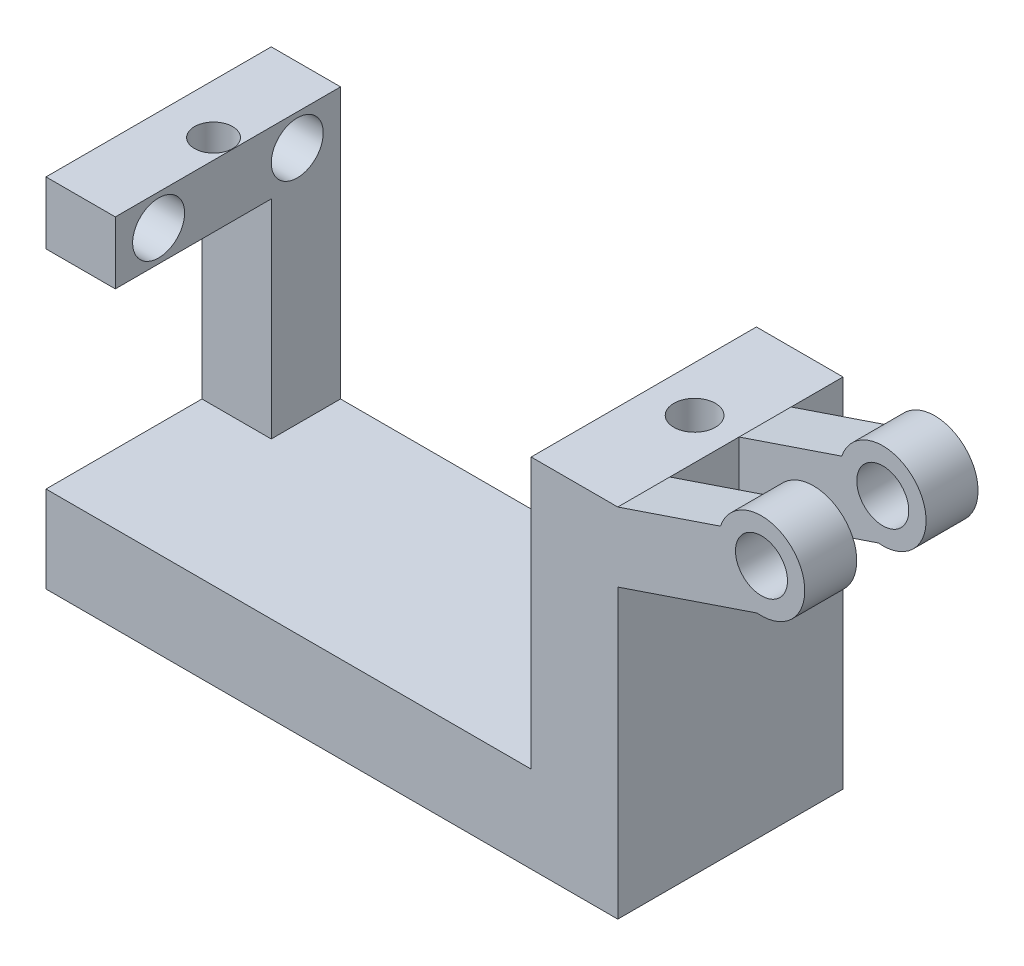
ISO-10303-21;
HEADER;
FILE_DESCRIPTION(('STEP AP214'),'2;1');
FILE_NAME('part.step','',(''),(''),'','','');
FILE_SCHEMA(('AUTOMOTIVE_DESIGN { 1 0 10303 214 1 1 1 1 }'));
ENDSEC;
DATA;
#1=APPLICATION_CONTEXT('core data for automotive mechanical design processes');
#2=APPLICATION_PROTOCOL_DEFINITION('international standard','automotive_design',2000,#1);
#3=PRODUCT_CONTEXT('',#1,'mechanical');
#4=PRODUCT('Part','Part','',(#3));
#5=PRODUCT_RELATED_PRODUCT_CATEGORY('part','',(#4));
#6=PRODUCT_DEFINITION_FORMATION('','',#4);
#7=PRODUCT_DEFINITION_CONTEXT('part definition',#1,'design');
#8=PRODUCT_DEFINITION('design','',#6,#7);
#9=PRODUCT_DEFINITION_SHAPE('','',#8);
#10=(LENGTH_UNIT() NAMED_UNIT(*) SI_UNIT(.MILLI.,.METRE.));
#11=(NAMED_UNIT(*) PLANE_ANGLE_UNIT() SI_UNIT($,.RADIAN.));
#12=(NAMED_UNIT(*) SI_UNIT($,.STERADIAN.) SOLID_ANGLE_UNIT());
#13=UNCERTAINTY_MEASURE_WITH_UNIT(LENGTH_MEASURE(1.E-05),#10,'distance_accuracy_value','');
#14=(GEOMETRIC_REPRESENTATION_CONTEXT(3) GLOBAL_UNCERTAINTY_ASSIGNED_CONTEXT((#13)) GLOBAL_UNIT_ASSIGNED_CONTEXT((#10,
#11,#12)) REPRESENTATION_CONTEXT('',''));
#15=CARTESIAN_POINT('',(0.,0.,0.));
#16=DIRECTION('',(0.,0.,1.));
#17=DIRECTION('',(1.,0.,0.));
#18=AXIS2_PLACEMENT_3D('',#15,#16,#17);
#19=CARTESIAN_POINT('',(16.5,20.6,13.));
#20=DIRECTION('',(-1.,0.,0.));
#21=DIRECTION('',(0.,-1.,0.));
#22=AXIS2_PLACEMENT_3D('',#19,#20,#21);
#23=PLANE('',#22);
#24=DIRECTION('',(0.,-1.,0.));
#25=VECTOR('',#24,1.);
#26=CARTESIAN_POINT('',(16.5,0.,6.));
#27=LINE('',#26,#25);
#28=CARTESIAN_POINT('',(16.5,20.6,6.));
#29=VERTEX_POINT('',#28);
#30=CARTESIAN_POINT('',(16.5,16.6000058853758,6.));
#31=VERTEX_POINT('',#30);
#32=EDGE_CURVE('E338',#29,#31,#27,.T.);
#33=ORIENTED_EDGE('',*,*,#32,.F.);
#34=DIRECTION('',(0.,0.,-1.));
#35=VECTOR('',#34,1.);
#36=CARTESIAN_POINT('',(16.5,20.6,13.));
#37=LINE('',#36,#35);
#38=CARTESIAN_POINT('',(16.5,20.6,10.));
#39=VERTEX_POINT('',#38);
#40=EDGE_CURVE('E211',#39,#29,#37,.T.);
#41=ORIENTED_EDGE('',*,*,#40,.F.);
#42=DIRECTION('',(0.,1.,0.));
#43=VECTOR('',#42,1.);
#44=CARTESIAN_POINT('',(16.5,0.,10.));
#45=LINE('',#44,#43);
#46=CARTESIAN_POINT('',(16.5,16.6000058853758,10.));
#47=VERTEX_POINT('',#46);
#48=EDGE_CURVE('E366',#47,#39,#45,.T.);
#49=ORIENTED_EDGE('',*,*,#48,.F.);
#50=DIRECTION('',(0.,0.,1.));
#51=VECTOR('',#50,1.);
#52=CARTESIAN_POINT('',(16.5,16.6000058853758,10.));
#53=LINE('',#52,#51);
#54=CARTESIAN_POINT('',(16.5,16.6000058853758,13.));
#55=VERTEX_POINT('',#54);
#56=EDGE_CURVE('E382',#47,#55,#53,.T.);
#57=ORIENTED_EDGE('',*,*,#56,.T.);
#58=DIRECTION('',(0.,1.,0.));
#59=VECTOR('',#58,1.);
#60=CARTESIAN_POINT('',(16.5,20.6,13.));
#61=LINE('',#60,#59);
#62=CARTESIAN_POINT('',(16.5,0.,13.));
#63=VERTEX_POINT('',#62);
#64=EDGE_CURVE('E254',#63,#55,#61,.T.);
#65=ORIENTED_EDGE('',*,*,#64,.F.);
#66=DIRECTION('',(0.,0.,-1.));
#67=VECTOR('',#66,1.);
#68=CARTESIAN_POINT('',(16.5,0.,13.));
#69=LINE('',#68,#67);
#70=CARTESIAN_POINT('',(16.5,0.,0.));
#71=VERTEX_POINT('',#70);
#72=EDGE_CURVE('E46',#63,#71,#69,.T.);
#73=ORIENTED_EDGE('',*,*,#72,.T.);
#74=DIRECTION('',(0.,1.,0.));
#75=VECTOR('',#74,1.);
#76=CARTESIAN_POINT('',(16.5,20.6,0.));
#77=LINE('',#76,#75);
#78=CARTESIAN_POINT('',(16.5,20.6,0.));
#79=VERTEX_POINT('',#78);
#80=EDGE_CURVE('E267',#71,#79,#77,.T.);
#81=ORIENTED_EDGE('',*,*,#80,.T.);
#82=CARTESIAN_POINT('',(16.5,20.6,3.));
#83=VERTEX_POINT('',#82);
#84=EDGE_CURVE('E207',#83,#79,#37,.T.);
#85=ORIENTED_EDGE('',*,*,#84,.F.);
#86=DIRECTION('',(0.,-1.,0.));
#87=VECTOR('',#86,1.);
#88=CARTESIAN_POINT('',(16.5,0.,3.));
#89=LINE('',#88,#87);
#90=CARTESIAN_POINT('',(16.5,16.6000058853758,3.));
#91=VERTEX_POINT('',#90);
#92=EDGE_CURVE('E330',#83,#91,#89,.T.);
#93=ORIENTED_EDGE('',*,*,#92,.T.);
#94=DIRECTION('',(0.,0.,-1.));
#95=VECTOR('',#94,1.);
#96=CARTESIAN_POINT('',(16.5,16.6000058853758,6.));
#97=LINE('',#96,#95);
#98=EDGE_CURVE('E355',#31,#91,#97,.T.);
#99=ORIENTED_EDGE('',*,*,#98,.F.);
#100=EDGE_LOOP('',(#33,#41,#49,#57,#65,#73,#81,#85,#93,#99));
#101=FACE_BOUND('',#100,.T.);
#102=ADVANCED_FACE('F37',(#101),#23,.F.);
#103=CARTESIAN_POINT('',(0.,0.,13.));
#104=DIRECTION('',(0.,0.,1.));
#105=DIRECTION('',(1.,0.,0.));
#106=AXIS2_PLACEMENT_3D('',#103,#104,#105);
#107=PLANE('',#106);
#108=DIRECTION('',(0.,-1.,0.));
#109=VECTOR('',#108,1.);
#110=CARTESIAN_POINT('',(-12.5,20.6,13.));
#111=LINE('',#110,#109);
#112=CARTESIAN_POINT('',(-12.5,20.6,13.));
#113=VERTEX_POINT('',#112);
#114=CARTESIAN_POINT('',(-12.5,17.,13.));
#115=VERTEX_POINT('',#114);
#116=EDGE_CURVE('E176',#113,#115,#111,.T.);
#117=ORIENTED_EDGE('',*,*,#116,.F.);
#118=DIRECTION('',(-1.,0.,0.));
#119=VECTOR('',#118,1.);
#120=CARTESIAN_POINT('',(-16.5,20.6,13.));
#121=LINE('',#120,#119);
#122=CARTESIAN_POINT('',(-16.5,20.6,13.));
#123=VERTEX_POINT('',#122);
#124=EDGE_CURVE('E184',#113,#123,#121,.T.);
#125=ORIENTED_EDGE('',*,*,#124,.T.);
#126=DIRECTION('',(0.,-1.,0.));
#127=VECTOR('',#126,1.);
#128=CARTESIAN_POINT('',(-16.5,20.6,13.));
#129=LINE('',#128,#127);
#130=CARTESIAN_POINT('',(-16.5,17.,13.));
#131=VERTEX_POINT('',#130);
#132=EDGE_CURVE('E193',#123,#131,#129,.T.);
#133=ORIENTED_EDGE('',*,*,#132,.T.);
#134=DIRECTION('',(1.,0.,0.));
#135=VECTOR('',#134,1.);
#136=CARTESIAN_POINT('',(-16.5,17.,13.));
#137=LINE('',#136,#135);
#138=EDGE_CURVE('E243',#131,#115,#137,.T.);
#139=ORIENTED_EDGE('',*,*,#138,.T.);
#140=EDGE_LOOP('',(#117,#125,#133,#139));
#141=FACE_BOUND('',#140,.T.);
#142=ADVANCED_FACE('F309',(#141),#107,.T.);
#143=CARTESIAN_POINT('',(-16.5,20.6,13.));
#144=DIRECTION('',(1.,0.,0.));
#145=DIRECTION('',(0.,1.,0.));
#146=AXIS2_PLACEMENT_3D('',#143,#144,#145);
#147=PLANE('',#146);
#148=CARTESIAN_POINT('',(-16.5,18.8,2.5));
#149=DIRECTION('',(1.,0.,0.));
#150=DIRECTION('',(0.,1.,0.));
#151=AXIS2_PLACEMENT_3D('',#148,#149,#150);
#152=CIRCLE('',#151,1.5);
#153=CARTESIAN_POINT('',(-16.5,20.3,2.5));
#154=VERTEX_POINT('',#153);
#155=EDGE_CURVE('E322',#154,#154,#152,.F.);
#156=ORIENTED_EDGE('',*,*,#155,.F.);
#157=EDGE_LOOP('',(#156));
#158=FACE_BOUND('',#157,.T.);
#159=CARTESIAN_POINT('',(-16.5,18.8,10.5));
#160=DIRECTION('',(1.,0.,0.));
#161=DIRECTION('',(0.,1.,0.));
#162=AXIS2_PLACEMENT_3D('',#159,#160,#161);
#163=CIRCLE('',#162,1.5);
#164=CARTESIAN_POINT('',(-16.5,20.3,10.5));
#165=VERTEX_POINT('',#164);
#166=EDGE_CURVE('E319',#165,#165,#163,.F.);
#167=ORIENTED_EDGE('',*,*,#166,.F.);
#168=EDGE_LOOP('',(#167));
#169=FACE_BOUND('',#168,.T.);
#170=DIRECTION('',(0.,1.,0.));
#171=VECTOR('',#170,1.);
#172=CARTESIAN_POINT('',(-16.5,5.,4.));
#173=LINE('',#172,#171);
#174=CARTESIAN_POINT('',(-16.5,5.,4.));
#175=VERTEX_POINT('',#174);
#176=CARTESIAN_POINT('',(-16.5,17.,4.));
#177=VERTEX_POINT('',#176);
#178=EDGE_CURVE('E220',#175,#177,#173,.T.);
#179=ORIENTED_EDGE('',*,*,#178,.T.);
#180=DIRECTION('',(0.,0.,1.));
#181=VECTOR('',#180,1.);
#182=CARTESIAN_POINT('',(-16.5,17.,13.));
#183=LINE('',#182,#181);
#184=EDGE_CURVE('E239',#177,#131,#183,.T.);
#185=ORIENTED_EDGE('',*,*,#184,.T.);
#186=ORIENTED_EDGE('',*,*,#132,.F.);
#187=DIRECTION('',(0.,0.,-1.));
#188=VECTOR('',#187,1.);
#189=CARTESIAN_POINT('',(-16.5,20.6,13.));
#190=LINE('',#189,#188);
#191=CARTESIAN_POINT('',(-16.5,20.6,0.));
#192=VERTEX_POINT('',#191);
#193=EDGE_CURVE('E199',#123,#192,#190,.T.);
#194=ORIENTED_EDGE('',*,*,#193,.T.);
#195=DIRECTION('',(0.,-1.,0.));
#196=VECTOR('',#195,1.);
#197=CARTESIAN_POINT('',(-16.5,20.6,0.));
#198=LINE('',#197,#196);
#199=CARTESIAN_POINT('',(-16.5,0.,0.));
#200=VERTEX_POINT('',#199);
#201=EDGE_CURVE('E189',#192,#200,#198,.T.);
#202=ORIENTED_EDGE('',*,*,#201,.T.);
#203=DIRECTION('',(0.,0.,-1.));
#204=VECTOR('',#203,1.);
#205=CARTESIAN_POINT('',(-16.5,0.,13.));
#206=LINE('',#205,#204);
#207=CARTESIAN_POINT('',(-16.5,0.,13.));
#208=VERTEX_POINT('',#207);
#209=EDGE_CURVE('E11',#208,#200,#206,.T.);
#210=ORIENTED_EDGE('',*,*,#209,.F.);
#211=CARTESIAN_POINT('',(-16.5,5.,13.));
#212=VERTEX_POINT('',#211);
#213=EDGE_CURVE('E190',#212,#208,#129,.T.);
#214=ORIENTED_EDGE('',*,*,#213,.F.);
#215=DIRECTION('',(0.,0.,-1.));
#216=VECTOR('',#215,1.);
#217=CARTESIAN_POINT('',(-16.5,5.,13.));
#218=LINE('',#217,#216);
#219=EDGE_CURVE('E215',#212,#175,#218,.T.);
#220=ORIENTED_EDGE('',*,*,#219,.T.);
#221=EDGE_LOOP('',(#179,#185,#186,#194,#202,#210,#214,#220));
#222=FACE_BOUND('',#221,.T.);
#223=ADVANCED_FACE('F39',(#158,#169,#222),#147,.F.);
#224=CARTESIAN_POINT('',(16.5,0.,13.));
#225=DIRECTION('',(0.,1.,0.));
#226=DIRECTION('',(0.,0.,1.));
#227=AXIS2_PLACEMENT_3D('',#224,#225,#226);
#228=PLANE('',#227);
#229=DIRECTION('',(1.,0.,0.));
#230=VECTOR('',#229,1.);
#231=CARTESIAN_POINT('',(16.5,0.,0.));
#232=LINE('',#231,#230);
#233=EDGE_CURVE('E265',#200,#71,#232,.T.);
#234=ORIENTED_EDGE('',*,*,#233,.T.);
#235=ORIENTED_EDGE('',*,*,#72,.F.);
#236=DIRECTION('',(1.,0.,0.));
#237=VECTOR('',#236,1.);
#238=CARTESIAN_POINT('',(-16.5,0.,13.));
#239=LINE('',#238,#237);
#240=EDGE_CURVE('E252',#208,#63,#239,.T.);
#241=ORIENTED_EDGE('',*,*,#240,.F.);
#242=ORIENTED_EDGE('',*,*,#209,.T.);
#243=EDGE_LOOP('',(#234,#235,#241,#242));
#244=FACE_BOUND('',#243,.T.);
#245=ADVANCED_FACE('F303',(#244),#228,.F.);
#246=CARTESIAN_POINT('',(16.5,20.6,13.));
#247=DIRECTION('',(0.,-1.,0.));
#248=DIRECTION('',(1.,0.,0.));
#249=AXIS2_PLACEMENT_3D('',#246,#247,#248);
#250=PLANE('',#249);
#251=CARTESIAN_POINT('',(14.1329641091364,20.6,6.2));
#252=DIRECTION('',(0.,1.,0.));
#253=DIRECTION('',(1.,0.,0.));
#254=AXIS2_PLACEMENT_3D('',#251,#252,#253);
#255=CIRCLE('',#254,1.2);
#256=CARTESIAN_POINT('',(15.3329641091364,20.6,6.2));
#257=VERTEX_POINT('',#256);
#258=EDGE_CURVE('E228',#257,#257,#255,.T.);
#259=ORIENTED_EDGE('',*,*,#258,.F.);
#260=EDGE_LOOP('',(#259));
#261=FACE_BOUND('',#260,.T.);
#262=DIRECTION('',(-1.,0.,0.));
#263=VECTOR('',#262,1.);
#264=CARTESIAN_POINT('',(16.5,20.6,0.));
#265=LINE('',#264,#263);
#266=CARTESIAN_POINT('',(11.5,20.6,0.));
#267=VERTEX_POINT('',#266);
#268=EDGE_CURVE('E270',#79,#267,#265,.T.);
#269=ORIENTED_EDGE('',*,*,#268,.T.);
#270=DIRECTION('',(0.,0.,-1.));
#271=VECTOR('',#270,1.);
#272=CARTESIAN_POINT('',(11.5,20.6,13.));
#273=LINE('',#272,#271);
#274=CARTESIAN_POINT('',(11.5,20.6,13.));
#275=VERTEX_POINT('',#274);
#276=EDGE_CURVE('E204',#275,#267,#273,.T.);
#277=ORIENTED_EDGE('',*,*,#276,.F.);
#278=DIRECTION('',(-1.,0.,0.));
#279=VECTOR('',#278,1.);
#280=CARTESIAN_POINT('',(16.5,20.6,13.));
#281=LINE('',#280,#279);
#282=CARTESIAN_POINT('',(16.5,20.6,13.));
#283=VERTEX_POINT('',#282);
#284=EDGE_CURVE('E257',#283,#275,#281,.T.);
#285=ORIENTED_EDGE('',*,*,#284,.F.);
#286=EDGE_CURVE('E208',#283,#39,#37,.T.);
#287=ORIENTED_EDGE('',*,*,#286,.T.);
#288=ORIENTED_EDGE('',*,*,#40,.T.);
#289=DIRECTION('',(0.,0.,-1.));
#290=VECTOR('',#289,1.);
#291=CARTESIAN_POINT('',(16.5,20.6,6.));
#292=LINE('',#291,#290);
#293=EDGE_CURVE('E352',#29,#83,#292,.T.);
#294=ORIENTED_EDGE('',*,*,#293,.T.);
#295=ORIENTED_EDGE('',*,*,#84,.T.);
#296=EDGE_LOOP('',(#269,#277,#285,#287,#288,#294,#295));
#297=FACE_BOUND('',#296,.T.);
#298=ADVANCED_FACE('F292',(#261,#297),#250,.F.);
#299=CARTESIAN_POINT('',(11.5,20.6,13.));
#300=DIRECTION('',(1.,0.,0.));
#301=DIRECTION('',(0.,0.,-1.));
#302=AXIS2_PLACEMENT_3D('',#299,#300,#301);
#303=PLANE('',#302);
#304=DIRECTION('',(0.,-1.,0.));
#305=VECTOR('',#304,1.);
#306=CARTESIAN_POINT('',(11.5,20.6,0.));
#307=LINE('',#306,#305);
#308=CARTESIAN_POINT('',(11.5,5.,0.));
#309=VERTEX_POINT('',#308);
#310=EDGE_CURVE('E195',#267,#309,#307,.T.);
#311=ORIENTED_EDGE('',*,*,#310,.T.);
#312=DIRECTION('',(0.,0.,-1.));
#313=VECTOR('',#312,1.);
#314=CARTESIAN_POINT('',(11.5,5.,13.));
#315=LINE('',#314,#313);
#316=CARTESIAN_POINT('',(11.5,5.,13.));
#317=VERTEX_POINT('',#316);
#318=EDGE_CURVE('E201',#317,#309,#315,.T.);
#319=ORIENTED_EDGE('',*,*,#318,.F.);
#320=DIRECTION('',(0.,-1.,0.));
#321=VECTOR('',#320,1.);
#322=CARTESIAN_POINT('',(11.5,20.6,13.));
#323=LINE('',#322,#321);
#324=EDGE_CURVE('E259',#275,#317,#323,.T.);
#325=ORIENTED_EDGE('',*,*,#324,.F.);
#326=ORIENTED_EDGE('',*,*,#276,.T.);
#327=EDGE_LOOP('',(#311,#319,#325,#326));
#328=FACE_BOUND('',#327,.T.);
#329=ADVANCED_FACE('F274',(#328),#303,.F.);
#330=CARTESIAN_POINT('',(11.5,5.,13.));
#331=DIRECTION('',(0.,-1.,0.));
#332=DIRECTION('',(1.,0.,0.));
#333=AXIS2_PLACEMENT_3D('',#330,#331,#332);
#334=PLANE('',#333);
#335=ORIENTED_EDGE('',*,*,#219,.F.);
#336=DIRECTION('',(-1.,0.,0.));
#337=VECTOR('',#336,1.);
#338=CARTESIAN_POINT('',(11.5,5.,13.));
#339=LINE('',#338,#337);
#340=EDGE_CURVE('E261',#317,#212,#339,.T.);
#341=ORIENTED_EDGE('',*,*,#340,.F.);
#342=ORIENTED_EDGE('',*,*,#318,.T.);
#343=DIRECTION('',(-1.,0.,0.));
#344=VECTOR('',#343,1.);
#345=CARTESIAN_POINT('',(11.5,5.,0.));
#346=LINE('',#345,#344);
#347=CARTESIAN_POINT('',(-12.5,5.,0.));
#348=VERTEX_POINT('',#347);
#349=EDGE_CURVE('E191',#309,#348,#346,.T.);
#350=ORIENTED_EDGE('',*,*,#349,.T.);
#351=DIRECTION('',(0.,0.,1.));
#352=VECTOR('',#351,1.);
#353=CARTESIAN_POINT('',(-12.5,5.,0.));
#354=LINE('',#353,#352);
#355=CARTESIAN_POINT('',(-12.5,5.,4.));
#356=VERTEX_POINT('',#355);
#357=EDGE_CURVE('E172',#348,#356,#354,.T.);
#358=ORIENTED_EDGE('',*,*,#357,.T.);
#359=DIRECTION('',(1.,0.,0.));
#360=VECTOR('',#359,1.);
#361=CARTESIAN_POINT('',(-16.5,5.,4.));
#362=LINE('',#361,#360);
#363=EDGE_CURVE('E242',#175,#356,#362,.T.);
#364=ORIENTED_EDGE('',*,*,#363,.F.);
#365=EDGE_LOOP('',(#335,#341,#342,#350,#358,#364));
#366=FACE_BOUND('',#365,.T.);
#367=ADVANCED_FACE('F281',(#366),#334,.F.);
#368=CARTESIAN_POINT('',(-16.5,20.6,13.));
#369=DIRECTION('',(0.,-1.,0.));
#370=DIRECTION('',(1.,0.,0.));
#371=AXIS2_PLACEMENT_3D('',#368,#369,#370);
#372=PLANE('',#371);
#373=CARTESIAN_POINT('',(-13.63,20.6,6.2));
#374=DIRECTION('',(0.,1.,0.));
#375=DIRECTION('',(-1.,0.,0.));
#376=AXIS2_PLACEMENT_3D('',#373,#374,#375);
#377=CIRCLE('',#376,1.1);
#378=CARTESIAN_POINT('',(-14.73,20.6,6.2));
#379=VERTEX_POINT('',#378);
#380=EDGE_CURVE('E216',#379,#379,#377,.T.);
#381=ORIENTED_EDGE('',*,*,#380,.F.);
#382=EDGE_LOOP('',(#381));
#383=FACE_BOUND('',#382,.T.);
#384=ORIENTED_EDGE('',*,*,#124,.F.);
#385=DIRECTION('',(0.,0.,1.));
#386=VECTOR('',#385,1.);
#387=CARTESIAN_POINT('',(-12.5,20.6,0.));
#388=LINE('',#387,#386);
#389=CARTESIAN_POINT('',(-12.5,20.6,0.));
#390=VERTEX_POINT('',#389);
#391=EDGE_CURVE('E169',#390,#113,#388,.T.);
#392=ORIENTED_EDGE('',*,*,#391,.F.);
#393=DIRECTION('',(-1.,0.,0.));
#394=VECTOR('',#393,1.);
#395=CARTESIAN_POINT('',(-16.5,20.6,0.));
#396=LINE('',#395,#394);
#397=EDGE_CURVE('E182',#390,#192,#396,.T.);
#398=ORIENTED_EDGE('',*,*,#397,.T.);
#399=ORIENTED_EDGE('',*,*,#193,.F.);
#400=EDGE_LOOP('',(#384,#392,#398,#399));
#401=FACE_BOUND('',#400,.T.);
#402=ADVANCED_FACE('F180',(#383,#401),#372,.F.);
#403=ORIENTED_EDGE('',*,*,#340,.T.);
#404=ORIENTED_EDGE('',*,*,#213,.T.);
#405=ORIENTED_EDGE('',*,*,#240,.T.);
#406=ORIENTED_EDGE('',*,*,#64,.T.);
#407=DIRECTION('',(0.947221216450547,0.32058067175977,0.));
#408=VECTOR('',#407,1.);
#409=CARTESIAN_POINT('',(-3.34503384023196,9.88358719763086,13.));
#410=LINE('',#409,#408);
#411=CARTESIAN_POINT('',(24.5388341727815,19.3206954291897,13.));
#412=VERTEX_POINT('',#411);
#413=EDGE_CURVE('E377',#55,#412,#410,.T.);
#414=ORIENTED_EDGE('',*,*,#413,.T.);
#415=CARTESIAN_POINT('',(24.7923213644905,21.8078110766093,13.));
#416=DIRECTION('',(0.,0.,1.));
#417=DIRECTION('',(1.,0.,0.));
#418=AXIS2_PLACEMENT_3D('',#415,#416,#417);
#419=CIRCLE('',#418,2.50000000000001);
#420=CARTESIAN_POINT('',(22.422658340374,22.6044899028216,13.));
#421=VERTEX_POINT('',#420);
#422=EDGE_CURVE('E354',#421,#412,#419,.F.);
#423=ORIENTED_EDGE('',*,*,#422,.F.);
#424=DIRECTION('',(0.94722093062692,0.320581516282943,0.));
#425=VECTOR('',#424,1.);
#426=CARTESIAN_POINT('',(-4.5596809656161,13.4724712069825,13.));
#427=LINE('',#426,#425);
#428=EDGE_CURVE('E290',#283,#421,#427,.T.);
#429=ORIENTED_EDGE('',*,*,#428,.F.);
#430=ORIENTED_EDGE('',*,*,#284,.T.);
#431=ORIENTED_EDGE('',*,*,#324,.T.);
#432=EDGE_LOOP('',(#403,#404,#405,#406,#414,#423,#429,#430,#431));
#433=FACE_BOUND('',#432,.T.);
#434=CARTESIAN_POINT('',(24.7923213644905,21.8078110766093,13.));
#435=DIRECTION('',(0.,0.,1.));
#436=DIRECTION('',(1.,0.,0.));
#437=AXIS2_PLACEMENT_3D('',#434,#435,#436);
#438=CIRCLE('',#437,1.5);
#439=CARTESIAN_POINT('',(26.2923213644905,21.8078110766093,13.));
#440=VERTEX_POINT('',#439);
#441=EDGE_CURVE('E364',#440,#440,#438,.F.);
#442=ORIENTED_EDGE('',*,*,#441,.T.);
#443=EDGE_LOOP('',(#442));
#444=FACE_BOUND('',#443,.T.);
#445=ADVANCED_FACE('F284',(#433,#444),#107,.T.);
#446=CARTESIAN_POINT('',(0.,0.,0.));
#447=DIRECTION('',(0.,0.,1.));
#448=DIRECTION('',(1.,0.,0.));
#449=AXIS2_PLACEMENT_3D('',#446,#447,#448);
#450=PLANE('',#449);
#451=DIRECTION('',(0.,-1.,0.));
#452=VECTOR('',#451,1.);
#453=CARTESIAN_POINT('',(-12.5,20.6,0.));
#454=LINE('',#453,#452);
#455=EDGE_CURVE('E166',#390,#348,#454,.T.);
#456=ORIENTED_EDGE('',*,*,#455,.T.);
#457=ORIENTED_EDGE('',*,*,#349,.F.);
#458=ORIENTED_EDGE('',*,*,#310,.F.);
#459=ORIENTED_EDGE('',*,*,#268,.F.);
#460=ORIENTED_EDGE('',*,*,#80,.F.);
#461=ORIENTED_EDGE('',*,*,#233,.F.);
#462=ORIENTED_EDGE('',*,*,#201,.F.);
#463=ORIENTED_EDGE('',*,*,#397,.F.);
#464=EDGE_LOOP('',(#456,#457,#458,#459,#460,#461,#462,#463));
#465=FACE_BOUND('',#464,.T.);
#466=ADVANCED_FACE('F187',(#465),#450,.F.);
#467=CARTESIAN_POINT('',(-16.5,17.,13.));
#468=DIRECTION('',(0.,1.,0.));
#469=DIRECTION('',(-1.,0.,0.));
#470=AXIS2_PLACEMENT_3D('',#467,#468,#469);
#471=PLANE('',#470);
#472=CARTESIAN_POINT('',(-13.63,17.,6.2));
#473=DIRECTION('',(0.,1.,0.));
#474=DIRECTION('',(-1.,0.,0.));
#475=AXIS2_PLACEMENT_3D('',#472,#473,#474);
#476=CIRCLE('',#475,1.1);
#477=CARTESIAN_POINT('',(-14.73,17.,6.2));
#478=VERTEX_POINT('',#477);
#479=EDGE_CURVE('E213',#478,#478,#476,.T.);
#480=ORIENTED_EDGE('',*,*,#479,.T.);
#481=EDGE_LOOP('',(#480));
#482=FACE_BOUND('',#481,.T.);
#483=DIRECTION('',(1.,0.,0.));
#484=VECTOR('',#483,1.);
#485=CARTESIAN_POINT('',(-16.5,17.,4.));
#486=LINE('',#485,#484);
#487=CARTESIAN_POINT('',(-12.5,17.,4.));
#488=VERTEX_POINT('',#487);
#489=EDGE_CURVE('E246',#177,#488,#486,.T.);
#490=ORIENTED_EDGE('',*,*,#489,.T.);
#491=DIRECTION('',(0.,0.,1.));
#492=VECTOR('',#491,1.);
#493=CARTESIAN_POINT('',(-12.5,17.,13.));
#494=LINE('',#493,#492);
#495=EDGE_CURVE('E54',#488,#115,#494,.T.);
#496=ORIENTED_EDGE('',*,*,#495,.T.);
#497=ORIENTED_EDGE('',*,*,#138,.F.);
#498=ORIENTED_EDGE('',*,*,#184,.F.);
#499=EDGE_LOOP('',(#490,#496,#497,#498));
#500=FACE_BOUND('',#499,.T.);
#501=ADVANCED_FACE('F553',(#482,#500),#471,.F.);
#502=CARTESIAN_POINT('',(-16.5,5.,4.));
#503=DIRECTION('',(0.,0.,-1.));
#504=DIRECTION('',(-1.,0.,0.));
#505=AXIS2_PLACEMENT_3D('',#502,#503,#504);
#506=PLANE('',#505);
#507=ORIENTED_EDGE('',*,*,#363,.T.);
#508=DIRECTION('',(0.,1.,0.));
#509=VECTOR('',#508,1.);
#510=CARTESIAN_POINT('',(-12.5,5.,4.));
#511=LINE('',#510,#509);
#512=EDGE_CURVE('E316',#356,#488,#511,.T.);
#513=ORIENTED_EDGE('',*,*,#512,.T.);
#514=ORIENTED_EDGE('',*,*,#489,.F.);
#515=ORIENTED_EDGE('',*,*,#178,.F.);
#516=EDGE_LOOP('',(#507,#513,#514,#515));
#517=FACE_BOUND('',#516,.T.);
#518=ADVANCED_FACE('F562',(#517),#506,.F.);
#519=CARTESIAN_POINT('',(-13.63,15.6,6.2));
#520=DIRECTION('',(0.,1.,0.));
#521=DIRECTION('',(-1.,0.,0.));
#522=AXIS2_PLACEMENT_3D('',#519,#520,#521);
#523=CYLINDRICAL_SURFACE('',#522,1.1);
#524=ORIENTED_EDGE('',*,*,#380,.T.);
#525=EDGE_LOOP('',(#524));
#526=FACE_BOUND('',#525,.T.);
#527=ORIENTED_EDGE('',*,*,#479,.F.);
#528=EDGE_LOOP('',(#527));
#529=FACE_BOUND('',#528,.T.);
#530=ADVANCED_FACE('F570',(#526,#529),#523,.F.);
#531=CARTESIAN_POINT('',(14.1329641091364,15.6,6.2));
#532=DIRECTION('',(0.,1.,0.));
#533=DIRECTION('',(-1.,0.,0.));
#534=AXIS2_PLACEMENT_3D('',#531,#532,#533);
#535=CYLINDRICAL_SURFACE('',#534,1.2);
#536=CARTESIAN_POINT('',(14.1329641091364,15.6,6.2));
#537=DIRECTION('',(0.,1.,0.));
#538=DIRECTION('',(1.,0.,0.));
#539=AXIS2_PLACEMENT_3D('',#536,#537,#538);
#540=CIRCLE('',#539,1.2);
#541=CARTESIAN_POINT('',(15.3329641091364,15.6,6.2));
#542=VERTEX_POINT('',#541);
#543=EDGE_CURVE('E223',#542,#542,#540,.T.);
#544=ORIENTED_EDGE('',*,*,#543,.F.);
#545=EDGE_LOOP('',(#544));
#546=FACE_BOUND('',#545,.T.);
#547=ORIENTED_EDGE('',*,*,#258,.T.);
#548=EDGE_LOOP('',(#547));
#549=FACE_BOUND('',#548,.T.);
#550=ADVANCED_FACE('F600',(#546,#549),#535,.F.);
#551=CARTESIAN_POINT('',(14.1329641091364,15.6,6.2));
#552=DIRECTION('',(0.,-1.,0.));
#553=DIRECTION('',(1.,0.,0.));
#554=AXIS2_PLACEMENT_3D('',#551,#552,#553);
#555=PLANE('',#554);
#556=ORIENTED_EDGE('',*,*,#543,.T.);
#557=EDGE_LOOP('',(#556));
#558=FACE_BOUND('',#557,.T.);
#559=ADVANCED_FACE('F607',(#558),#555,.F.);
#560=CARTESIAN_POINT('',(24.7923213644905,21.8078110766093,10.));
#561=DIRECTION('',(0.,0.,1.));
#562=DIRECTION('',(1.,0.,0.));
#563=AXIS2_PLACEMENT_3D('',#560,#561,#562);
#564=CYLINDRICAL_SURFACE('',#563,2.50000000000001);
#565=ORIENTED_EDGE('',*,*,#422,.T.);
#566=DIRECTION('',(0.,0.,1.));
#567=VECTOR('',#566,1.);
#568=CARTESIAN_POINT('',(24.5388341727815,19.3206954291897,10.));
#569=LINE('',#568,#567);
#570=CARTESIAN_POINT('',(24.5388341727815,19.3206954291897,10.));
#571=VERTEX_POINT('',#570);
#572=EDGE_CURVE('E235',#571,#412,#569,.T.);
#573=ORIENTED_EDGE('',*,*,#572,.F.);
#574=CARTESIAN_POINT('',(24.7923213644905,21.8078110766093,10.));
#575=DIRECTION('',(0.,0.,1.));
#576=DIRECTION('',(1.,0.,0.));
#577=AXIS2_PLACEMENT_3D('',#574,#575,#576);
#578=CIRCLE('',#577,2.50000000000001);
#579=CARTESIAN_POINT('',(22.422658340374,22.6044899028216,10.));
#580=VERTEX_POINT('',#579);
#581=EDGE_CURVE('E361',#580,#571,#578,.F.);
#582=ORIENTED_EDGE('',*,*,#581,.F.);
#583=DIRECTION('',(0.,0.,1.));
#584=VECTOR('',#583,1.);
#585=CARTESIAN_POINT('',(22.422658340374,22.6044899028216,10.));
#586=LINE('',#585,#584);
#587=EDGE_CURVE('E231',#580,#421,#586,.T.);
#588=ORIENTED_EDGE('',*,*,#587,.T.);
#589=EDGE_LOOP('',(#565,#573,#582,#588));
#590=FACE_BOUND('',#589,.T.);
#591=ADVANCED_FACE('F388',(#590),#564,.T.);
#592=CARTESIAN_POINT('',(-3.34503384023196,9.88358719763086,10.));
#593=DIRECTION('',(0.32058067175977,-0.947221216450548,0.));
#594=DIRECTION('',(0.947221216450548,0.32058067175977,0.));
#595=AXIS2_PLACEMENT_3D('',#592,#593,#594);
#596=PLANE('',#595);
#597=ORIENTED_EDGE('',*,*,#413,.F.);
#598=ORIENTED_EDGE('',*,*,#56,.F.);
#599=DIRECTION('',(0.947221216450547,0.32058067175977,0.));
#600=VECTOR('',#599,1.);
#601=CARTESIAN_POINT('',(-3.34503384023196,9.88358719763086,10.));
#602=LINE('',#601,#600);
#603=EDGE_CURVE('E368',#47,#571,#602,.T.);
#604=ORIENTED_EDGE('',*,*,#603,.T.);
#605=ORIENTED_EDGE('',*,*,#572,.T.);
#606=EDGE_LOOP('',(#597,#598,#604,#605));
#607=FACE_BOUND('',#606,.T.);
#608=ADVANCED_FACE('F393',(#607),#596,.T.);
#609=CARTESIAN_POINT('',(-4.5596809656161,13.4724712069825,10.));
#610=DIRECTION('',(0.320581516282943,-0.94722093062692,0.));
#611=DIRECTION('',(0.94722093062692,0.320581516282944,0.));
#612=AXIS2_PLACEMENT_3D('',#609,#610,#611);
#613=PLANE('',#612);
#614=ORIENTED_EDGE('',*,*,#428,.T.);
#615=ORIENTED_EDGE('',*,*,#587,.F.);
#616=DIRECTION('',(0.94722093062692,0.320581516282943,0.));
#617=VECTOR('',#616,1.);
#618=CARTESIAN_POINT('',(-4.5596809656161,13.4724712069825,10.));
#619=LINE('',#618,#617);
#620=EDGE_CURVE('E363',#39,#580,#619,.T.);
#621=ORIENTED_EDGE('',*,*,#620,.F.);
#622=ORIENTED_EDGE('',*,*,#286,.F.);
#623=EDGE_LOOP('',(#614,#615,#621,#622));
#624=FACE_BOUND('',#623,.T.);
#625=ADVANCED_FACE('F401',(#624),#613,.F.);
#626=CARTESIAN_POINT('',(24.7923213644905,21.8078110766093,10.));
#627=DIRECTION('',(0.,0.,1.));
#628=DIRECTION('',(1.,0.,0.));
#629=AXIS2_PLACEMENT_3D('',#626,#627,#628);
#630=CYLINDRICAL_SURFACE('',#629,1.5);
#631=CARTESIAN_POINT('',(24.7923213644905,21.8078110766093,10.));
#632=DIRECTION('',(0.,0.,1.));
#633=DIRECTION('',(1.,0.,0.));
#634=AXIS2_PLACEMENT_3D('',#631,#632,#633);
#635=CIRCLE('',#634,1.5);
#636=CARTESIAN_POINT('',(26.2923213644905,21.8078110766093,10.));
#637=VERTEX_POINT('',#636);
#638=EDGE_CURVE('E371',#637,#637,#635,.F.);
#639=ORIENTED_EDGE('',*,*,#638,.T.);
#640=EDGE_LOOP('',(#639));
#641=FACE_BOUND('',#640,.T.);
#642=ORIENTED_EDGE('',*,*,#441,.F.);
#643=EDGE_LOOP('',(#642));
#644=FACE_BOUND('',#643,.T.);
#645=ADVANCED_FACE('F403',(#641,#644),#630,.F.);
#646=CARTESIAN_POINT('',(0.,0.,10.));
#647=DIRECTION('',(0.,0.,1.));
#648=DIRECTION('',(1.,0.,0.));
#649=AXIS2_PLACEMENT_3D('',#646,#647,#648);
#650=PLANE('',#649);
#651=ORIENTED_EDGE('',*,*,#581,.T.);
#652=ORIENTED_EDGE('',*,*,#603,.F.);
#653=ORIENTED_EDGE('',*,*,#48,.T.);
#654=ORIENTED_EDGE('',*,*,#620,.T.);
#655=EDGE_LOOP('',(#651,#652,#653,#654));
#656=FACE_BOUND('',#655,.T.);
#657=ORIENTED_EDGE('',*,*,#638,.F.);
#658=EDGE_LOOP('',(#657));
#659=FACE_BOUND('',#658,.T.);
#660=ADVANCED_FACE('F396',(#656,#659),#650,.F.);
#661=CARTESIAN_POINT('',(-4.55967709573125,13.4724993292071,6.));
#662=DIRECTION('',(-0.320580671759769,0.947221216450548,0.));
#663=DIRECTION('',(-0.947221216450548,-0.320580671759769,0.));
#664=AXIS2_PLACEMENT_3D('',#661,#662,#663);
#665=PLANE('',#664);
#666=DIRECTION('',(0.947221216450548,0.320580671759769,0.));
#667=VECTOR('',#666,1.);
#668=CARTESIAN_POINT('',(-4.55967709573125,13.4724993292071,3.));
#669=LINE('',#668,#667);
#670=CARTESIAN_POINT('',(22.422658340374,22.6044899028216,3.));
#671=VERTEX_POINT('',#670);
#672=EDGE_CURVE('E62',#83,#671,#669,.T.);
#673=ORIENTED_EDGE('',*,*,#672,.F.);
#674=ORIENTED_EDGE('',*,*,#293,.F.);
#675=DIRECTION('',(0.947221216450548,0.320580671759769,0.));
#676=VECTOR('',#675,1.);
#677=CARTESIAN_POINT('',(-4.55967709573125,13.4724993292071,6.));
#678=LINE('',#677,#676);
#679=CARTESIAN_POINT('',(22.422658340374,22.6044899028216,6.));
#680=VERTEX_POINT('',#679);
#681=EDGE_CURVE('E329',#29,#680,#678,.T.);
#682=ORIENTED_EDGE('',*,*,#681,.T.);
#683=DIRECTION('',(0.,0.,-1.));
#684=VECTOR('',#683,1.);
#685=CARTESIAN_POINT('',(22.422658340374,22.6044899028216,6.));
#686=LINE('',#685,#684);
#687=EDGE_CURVE('E341',#680,#671,#686,.T.);
#688=ORIENTED_EDGE('',*,*,#687,.T.);
#689=EDGE_LOOP('',(#673,#674,#682,#688));
#690=FACE_BOUND('',#689,.T.);
#691=ADVANCED_FACE('F460',(#690),#665,.T.);
#692=CARTESIAN_POINT('',(-3.34503384023196,9.88358719763088,6.));
#693=DIRECTION('',(-0.320580671759769,0.947221216450548,0.));
#694=DIRECTION('',(-0.947221216450548,-0.320580671759769,0.));
#695=AXIS2_PLACEMENT_3D('',#692,#693,#694);
#696=PLANE('',#695);
#697=DIRECTION('',(0.947221216450548,0.320580671759769,0.));
#698=VECTOR('',#697,1.);
#699=CARTESIAN_POINT('',(-3.34503384023196,9.88358719763088,3.));
#700=LINE('',#699,#698);
#701=CARTESIAN_POINT('',(24.5388341727815,19.3206954291897,3.));
#702=VERTEX_POINT('',#701);
#703=EDGE_CURVE('E348',#91,#702,#700,.T.);
#704=ORIENTED_EDGE('',*,*,#703,.T.);
#705=DIRECTION('',(0.,0.,-1.));
#706=VECTOR('',#705,1.);
#707=CARTESIAN_POINT('',(24.5388341727815,19.3206954291897,6.));
#708=LINE('',#707,#706);
#709=CARTESIAN_POINT('',(24.5388341727815,19.3206954291897,6.));
#710=VERTEX_POINT('',#709);
#711=EDGE_CURVE('E358',#710,#702,#708,.T.);
#712=ORIENTED_EDGE('',*,*,#711,.F.);
#713=DIRECTION('',(0.947221216450548,0.320580671759769,0.));
#714=VECTOR('',#713,1.);
#715=CARTESIAN_POINT('',(-3.34503384023196,9.88358719763088,6.));
#716=LINE('',#715,#714);
#717=EDGE_CURVE('E336',#31,#710,#716,.T.);
#718=ORIENTED_EDGE('',*,*,#717,.F.);
#719=ORIENTED_EDGE('',*,*,#98,.T.);
#720=EDGE_LOOP('',(#704,#712,#718,#719));
#721=FACE_BOUND('',#720,.T.);
#722=ADVANCED_FACE('F456',(#721),#696,.F.);
#723=CARTESIAN_POINT('',(24.7923213644905,21.8078110766093,6.));
#724=DIRECTION('',(0.,0.,-1.));
#725=DIRECTION('',(-1.,0.,0.));
#726=AXIS2_PLACEMENT_3D('',#723,#724,#725);
#727=CYLINDRICAL_SURFACE('',#726,1.5);
#728=CARTESIAN_POINT('',(24.7923213644905,21.8078110766093,6.));
#729=DIRECTION('',(0.,0.,-1.));
#730=DIRECTION('',(-1.,0.,0.));
#731=AXIS2_PLACEMENT_3D('',#728,#729,#730);
#732=CIRCLE('',#731,1.5);
#733=CARTESIAN_POINT('',(23.2923213644905,21.8078110766093,6.));
#734=VERTEX_POINT('',#733);
#735=EDGE_CURVE('E326',#734,#734,#732,.T.);
#736=ORIENTED_EDGE('',*,*,#735,.F.);
#737=EDGE_LOOP('',(#736));
#738=FACE_BOUND('',#737,.T.);
#739=CARTESIAN_POINT('',(24.7923213644905,21.8078110766093,3.));
#740=DIRECTION('',(0.,0.,-1.));
#741=DIRECTION('',(-1.,0.,0.));
#742=AXIS2_PLACEMENT_3D('',#739,#740,#741);
#743=CIRCLE('',#742,1.5);
#744=CARTESIAN_POINT('',(23.2923213644905,21.8078110766093,3.));
#745=VERTEX_POINT('',#744);
#746=EDGE_CURVE('E325',#745,#745,#743,.T.);
#747=ORIENTED_EDGE('',*,*,#746,.T.);
#748=EDGE_LOOP('',(#747));
#749=FACE_BOUND('',#748,.T.);
#750=ADVANCED_FACE('F459',(#738,#749),#727,.F.);
#751=CARTESIAN_POINT('',(24.7923213644905,21.8078110766093,6.));
#752=DIRECTION('',(0.,0.,-1.));
#753=DIRECTION('',(-1.,0.,0.));
#754=AXIS2_PLACEMENT_3D('',#751,#752,#753);
#755=CYLINDRICAL_SURFACE('',#754,2.5);
#756=CARTESIAN_POINT('',(24.7923213644905,21.8078110766093,3.));
#757=DIRECTION('',(0.,0.,-1.));
#758=DIRECTION('',(-1.,0.,0.));
#759=AXIS2_PLACEMENT_3D('',#756,#757,#758);
#760=CIRCLE('',#759,2.5);
#761=EDGE_CURVE('E345',#671,#702,#760,.T.);
#762=ORIENTED_EDGE('',*,*,#761,.F.);
#763=ORIENTED_EDGE('',*,*,#687,.F.);
#764=CARTESIAN_POINT('',(24.7923213644905,21.8078110766093,6.));
#765=DIRECTION('',(0.,0.,-1.));
#766=DIRECTION('',(-1.,0.,0.));
#767=AXIS2_PLACEMENT_3D('',#764,#765,#766);
#768=CIRCLE('',#767,2.5);
#769=EDGE_CURVE('E333',#680,#710,#768,.T.);
#770=ORIENTED_EDGE('',*,*,#769,.T.);
#771=ORIENTED_EDGE('',*,*,#711,.T.);
#772=EDGE_LOOP('',(#762,#763,#770,#771));
#773=FACE_BOUND('',#772,.T.);
#774=ADVANCED_FACE('F453',(#773),#755,.T.);
#775=CARTESIAN_POINT('',(0.,0.,6.));
#776=DIRECTION('',(0.,0.,-1.));
#777=DIRECTION('',(-1.,0.,0.));
#778=AXIS2_PLACEMENT_3D('',#775,#776,#777);
#779=PLANE('',#778);
#780=ORIENTED_EDGE('',*,*,#735,.T.);
#781=EDGE_LOOP('',(#780));
#782=FACE_BOUND('',#781,.T.);
#783=ORIENTED_EDGE('',*,*,#681,.F.);
#784=ORIENTED_EDGE('',*,*,#32,.T.);
#785=ORIENTED_EDGE('',*,*,#717,.T.);
#786=ORIENTED_EDGE('',*,*,#769,.F.);
#787=EDGE_LOOP('',(#783,#784,#785,#786));
#788=FACE_BOUND('',#787,.T.);
#789=ADVANCED_FACE('F446',(#782,#788),#779,.F.);
#790=CARTESIAN_POINT('',(0.,0.,3.));
#791=DIRECTION('',(0.,0.,-1.));
#792=DIRECTION('',(-1.,0.,0.));
#793=AXIS2_PLACEMENT_3D('',#790,#791,#792);
#794=PLANE('',#793);
#795=ORIENTED_EDGE('',*,*,#746,.F.);
#796=EDGE_LOOP('',(#795));
#797=FACE_BOUND('',#796,.T.);
#798=ORIENTED_EDGE('',*,*,#672,.T.);
#799=ORIENTED_EDGE('',*,*,#761,.T.);
#800=ORIENTED_EDGE('',*,*,#703,.F.);
#801=ORIENTED_EDGE('',*,*,#92,.F.);
#802=EDGE_LOOP('',(#798,#799,#800,#801));
#803=FACE_BOUND('',#802,.T.);
#804=ADVANCED_FACE('F437',(#797,#803),#794,.T.);
#805=CARTESIAN_POINT('',(-16.500012,18.8,10.5));
#806=DIRECTION('',(1.,0.,0.));
#807=DIRECTION('',(0.,1.,0.));
#808=AXIS2_PLACEMENT_3D('',#805,#806,#807);
#809=CYLINDRICAL_SURFACE('',#808,1.5);
#810=CARTESIAN_POINT('',(-12.5,18.8,10.5));
#811=DIRECTION('',(-1.,0.,0.));
#812=DIRECTION('',(0.,-1.,0.));
#813=AXIS2_PLACEMENT_3D('',#810,#811,#812);
#814=CIRCLE('',#813,1.5);
#815=CARTESIAN_POINT('',(-12.5,20.3,10.5));
#816=VERTEX_POINT('',#815);
#817=EDGE_CURVE('E313',#816,#816,#814,.T.);
#818=CARTESIAN_POINT('',(-12.5,20.3,10.5));
#819=CARTESIAN_POINT('',(-12.5416666666667,20.3,10.5));
#820=CARTESIAN_POINT('',(-12.5833333333333,20.3,10.5));
#821=CARTESIAN_POINT('',(-12.6666666666667,20.3,10.5));
#822=CARTESIAN_POINT('',(-12.7083333333333,20.3,10.5));
#823=CARTESIAN_POINT('',(-12.7916666666667,20.3,10.5));
#824=CARTESIAN_POINT('',(-12.8333333333333,20.3,10.5));
#825=CARTESIAN_POINT('',(-12.9166666666667,20.3,10.5));
#826=CARTESIAN_POINT('',(-12.9583333333333,20.3,10.5));
#827=CARTESIAN_POINT('',(-13.0416666666667,20.3,10.5));
#828=CARTESIAN_POINT('',(-13.0833333333333,20.3,10.5));
#829=CARTESIAN_POINT('',(-13.1666666666667,20.3,10.5));
#830=CARTESIAN_POINT('',(-13.2083333333333,20.3,10.5));
#831=CARTESIAN_POINT('',(-13.2916666666667,20.3,10.5));
#832=CARTESIAN_POINT('',(-13.3333333333333,20.3,10.5));
#833=CARTESIAN_POINT('',(-13.4166666666667,20.3,10.5));
#834=CARTESIAN_POINT('',(-13.4583333333333,20.3,10.5));
#835=CARTESIAN_POINT('',(-13.5416666666667,20.3,10.5));
#836=CARTESIAN_POINT('',(-13.5833333333333,20.3,10.5));
#837=CARTESIAN_POINT('',(-13.6666666666667,20.3,10.5));
#838=CARTESIAN_POINT('',(-13.7083333333333,20.3,10.5));
#839=CARTESIAN_POINT('',(-13.7916666666667,20.3,10.5));
#840=CARTESIAN_POINT('',(-13.8333333333333,20.3,10.5));
#841=CARTESIAN_POINT('',(-13.9166666666667,20.3,10.5));
#842=CARTESIAN_POINT('',(-13.9583333333333,20.3,10.5));
#843=CARTESIAN_POINT('',(-14.0416666666667,20.3,10.5));
#844=CARTESIAN_POINT('',(-14.0833333333333,20.3,10.5));
#845=CARTESIAN_POINT('',(-14.1666666666667,20.3,10.5));
#846=CARTESIAN_POINT('',(-14.2083333333333,20.3,10.5));
#847=CARTESIAN_POINT('',(-14.2916666666667,20.3,10.5));
#848=CARTESIAN_POINT('',(-14.3333333333333,20.3,10.5));
#849=CARTESIAN_POINT('',(-14.4166666666667,20.3,10.5));
#850=CARTESIAN_POINT('',(-14.4583333333333,20.3,10.5));
#851=CARTESIAN_POINT('',(-14.5416666666667,20.3,10.5));
#852=CARTESIAN_POINT('',(-14.5833333333333,20.3,10.5));
#853=CARTESIAN_POINT('',(-14.6666666666667,20.3,10.5));
#854=CARTESIAN_POINT('',(-14.7083333333333,20.3,10.5));
#855=CARTESIAN_POINT('',(-14.7916666666667,20.3,10.5));
#856=CARTESIAN_POINT('',(-14.8333333333333,20.3,10.5));
#857=CARTESIAN_POINT('',(-14.9166666666667,20.3,10.5));
#858=CARTESIAN_POINT('',(-14.9583333333333,20.3,10.5));
#859=CARTESIAN_POINT('',(-15.0416666666667,20.3,10.5));
#860=CARTESIAN_POINT('',(-15.0833333333333,20.3,10.5));
#861=CARTESIAN_POINT('',(-15.1666666666667,20.3,10.5));
#862=CARTESIAN_POINT('',(-15.2083333333333,20.3,10.5));
#863=CARTESIAN_POINT('',(-15.2916666666667,20.3,10.5));
#864=CARTESIAN_POINT('',(-15.3333333333333,20.3,10.5));
#865=CARTESIAN_POINT('',(-15.4166666666667,20.3,10.5));
#866=CARTESIAN_POINT('',(-15.4583333333333,20.3,10.5));
#867=CARTESIAN_POINT('',(-15.5416666666667,20.3,10.5));
#868=CARTESIAN_POINT('',(-15.5833333333333,20.3,10.5));
#869=CARTESIAN_POINT('',(-15.6666666666667,20.3,10.5));
#870=CARTESIAN_POINT('',(-15.7083333333333,20.3,10.5));
#871=CARTESIAN_POINT('',(-15.7916666666667,20.3,10.5));
#872=CARTESIAN_POINT('',(-15.8333333333333,20.3,10.5));
#873=CARTESIAN_POINT('',(-15.9166666666667,20.3,10.5));
#874=CARTESIAN_POINT('',(-15.9583333333333,20.3,10.5));
#875=CARTESIAN_POINT('',(-16.0416666666667,20.3,10.5));
#876=CARTESIAN_POINT('',(-16.0833333333333,20.3,10.5));
#877=CARTESIAN_POINT('',(-16.1666666666667,20.3,10.5));
#878=CARTESIAN_POINT('',(-16.2083333333333,20.3,10.5));
#879=CARTESIAN_POINT('',(-16.2916666666667,20.3,10.5));
#880=CARTESIAN_POINT('',(-16.3333333333333,20.3,10.5));
#881=CARTESIAN_POINT('',(-16.4166666666667,20.3,10.5));
#882=CARTESIAN_POINT('',(-16.4583333333333,20.3,10.5));
#883=CARTESIAN_POINT('',(-16.5,20.3,10.5));
#884=B_SPLINE_CURVE_WITH_KNOTS('',3,(#818,#819,#820,#821,#822,#823,#824,#825,#826,#827,#828,
#829,#830,#831,#832,#833,#834,#835,#836,#837,#838,#839,#840,#841,#842,#843,#844,#845,#846,#847,
#848,#849,#850,#851,#852,#853,#854,#855,#856,#857,#858,#859,#860,#861,#862,#863,#864,#865,#866,
#867,#868,#869,#870,#871,#872,#873,#874,#875,#876,#877,#878,#879,#880,#881,#882,#883),
.UNSPECIFIED.,.F.,.F.,(4,2,2,2,2,2,2,2,2,2,2,2,2,2,2,2,2,2,2,2,2,2,2,2,2,2,2,2,2,2,2,2,4),(0.,
0.125,0.25,0.375,0.5,0.625000000000001,0.750000000000001,0.875000000000001,1.,1.125,1.25,1.375,
1.5,1.625,1.75,1.875,2.,2.125,2.25,2.375,2.5,2.625,2.75,2.875,3.,3.125,3.25,3.375,3.5,3.625,
3.75,3.875,4.),.UNSPECIFIED.);
#885=EDGE_CURVE('BSEAM434',#816,#165,#884,.T.);
#886=ORIENTED_EDGE('',*,*,#817,.F.);
#887=ORIENTED_EDGE('',*,*,#166,.T.);
#888=ORIENTED_EDGE('',*,*,#885,.T.);
#889=ORIENTED_EDGE('',*,*,#885,.F.);
#890=EDGE_LOOP('',(#886,#888,#887,#889));
#891=FACE_BOUND('',#890,.T.);
#892=ADVANCED_FACE('F434',(#891),#809,.F.);
#893=CARTESIAN_POINT('',(-16.500012,18.8,2.5));
#894=DIRECTION('',(1.,0.,0.));
#895=DIRECTION('',(0.,1.,0.));
#896=AXIS2_PLACEMENT_3D('',#893,#894,#895);
#897=CYLINDRICAL_SURFACE('',#896,1.5);
#898=CARTESIAN_POINT('',(-12.5,18.8,2.5));
#899=DIRECTION('',(-1.,0.,0.));
#900=DIRECTION('',(0.,-1.,0.));
#901=AXIS2_PLACEMENT_3D('',#898,#899,#900);
#902=CIRCLE('',#901,1.5);
#903=CARTESIAN_POINT('',(-12.5,20.3,2.5));
#904=VERTEX_POINT('',#903);
#905=EDGE_CURVE('E41',#904,#904,#902,.T.);
#906=CARTESIAN_POINT('',(-12.5,20.3,2.5));
#907=CARTESIAN_POINT('',(-12.5416666666667,20.3,2.5));
#908=CARTESIAN_POINT('',(-12.5833333333333,20.3,2.5));
#909=CARTESIAN_POINT('',(-12.6666666666667,20.3,2.5));
#910=CARTESIAN_POINT('',(-12.7083333333333,20.3,2.5));
#911=CARTESIAN_POINT('',(-12.7916666666667,20.3,2.5));
#912=CARTESIAN_POINT('',(-12.8333333333333,20.3,2.5));
#913=CARTESIAN_POINT('',(-12.9166666666667,20.3,2.5));
#914=CARTESIAN_POINT('',(-12.9583333333333,20.3,2.5));
#915=CARTESIAN_POINT('',(-13.0416666666667,20.3,2.5));
#916=CARTESIAN_POINT('',(-13.0833333333333,20.3,2.5));
#917=CARTESIAN_POINT('',(-13.1666666666667,20.3,2.5));
#918=CARTESIAN_POINT('',(-13.2083333333333,20.3,2.5));
#919=CARTESIAN_POINT('',(-13.2916666666667,20.3,2.5));
#920=CARTESIAN_POINT('',(-13.3333333333333,20.3,2.5));
#921=CARTESIAN_POINT('',(-13.4166666666667,20.3,2.5));
#922=CARTESIAN_POINT('',(-13.4583333333333,20.3,2.5));
#923=CARTESIAN_POINT('',(-13.5416666666667,20.3,2.5));
#924=CARTESIAN_POINT('',(-13.5833333333333,20.3,2.5));
#925=CARTESIAN_POINT('',(-13.6666666666667,20.3,2.5));
#926=CARTESIAN_POINT('',(-13.7083333333333,20.3,2.5));
#927=CARTESIAN_POINT('',(-13.7916666666667,20.3,2.5));
#928=CARTESIAN_POINT('',(-13.8333333333333,20.3,2.5));
#929=CARTESIAN_POINT('',(-13.9166666666667,20.3,2.5));
#930=CARTESIAN_POINT('',(-13.9583333333333,20.3,2.5));
#931=CARTESIAN_POINT('',(-14.0416666666667,20.3,2.5));
#932=CARTESIAN_POINT('',(-14.0833333333333,20.3,2.5));
#933=CARTESIAN_POINT('',(-14.1666666666667,20.3,2.5));
#934=CARTESIAN_POINT('',(-14.2083333333333,20.3,2.5));
#935=CARTESIAN_POINT('',(-14.2916666666667,20.3,2.5));
#936=CARTESIAN_POINT('',(-14.3333333333333,20.3,2.5));
#937=CARTESIAN_POINT('',(-14.4166666666667,20.3,2.5));
#938=CARTESIAN_POINT('',(-14.4583333333333,20.3,2.5));
#939=CARTESIAN_POINT('',(-14.5416666666667,20.3,2.5));
#940=CARTESIAN_POINT('',(-14.5833333333333,20.3,2.5));
#941=CARTESIAN_POINT('',(-14.6666666666667,20.3,2.5));
#942=CARTESIAN_POINT('',(-14.7083333333333,20.3,2.5));
#943=CARTESIAN_POINT('',(-14.7916666666667,20.3,2.5));
#944=CARTESIAN_POINT('',(-14.8333333333333,20.3,2.5));
#945=CARTESIAN_POINT('',(-14.9166666666667,20.3,2.5));
#946=CARTESIAN_POINT('',(-14.9583333333333,20.3,2.5));
#947=CARTESIAN_POINT('',(-15.0416666666667,20.3,2.5));
#948=CARTESIAN_POINT('',(-15.0833333333333,20.3,2.5));
#949=CARTESIAN_POINT('',(-15.1666666666667,20.3,2.5));
#950=CARTESIAN_POINT('',(-15.2083333333333,20.3,2.5));
#951=CARTESIAN_POINT('',(-15.2916666666667,20.3,2.5));
#952=CARTESIAN_POINT('',(-15.3333333333333,20.3,2.5));
#953=CARTESIAN_POINT('',(-15.4166666666667,20.3,2.5));
#954=CARTESIAN_POINT('',(-15.4583333333333,20.3,2.5));
#955=CARTESIAN_POINT('',(-15.5416666666667,20.3,2.5));
#956=CARTESIAN_POINT('',(-15.5833333333333,20.3,2.5));
#957=CARTESIAN_POINT('',(-15.6666666666667,20.3,2.5));
#958=CARTESIAN_POINT('',(-15.7083333333333,20.3,2.5));
#959=CARTESIAN_POINT('',(-15.7916666666667,20.3,2.5));
#960=CARTESIAN_POINT('',(-15.8333333333333,20.3,2.5));
#961=CARTESIAN_POINT('',(-15.9166666666667,20.3,2.5));
#962=CARTESIAN_POINT('',(-15.9583333333333,20.3,2.5));
#963=CARTESIAN_POINT('',(-16.0416666666667,20.3,2.5));
#964=CARTESIAN_POINT('',(-16.0833333333333,20.3,2.5));
#965=CARTESIAN_POINT('',(-16.1666666666667,20.3,2.5));
#966=CARTESIAN_POINT('',(-16.2083333333333,20.3,2.5));
#967=CARTESIAN_POINT('',(-16.2916666666667,20.3,2.5));
#968=CARTESIAN_POINT('',(-16.3333333333333,20.3,2.5));
#969=CARTESIAN_POINT('',(-16.4166666666667,20.3,2.5));
#970=CARTESIAN_POINT('',(-16.4583333333333,20.3,2.5));
#971=CARTESIAN_POINT('',(-16.5,20.3,2.5));
#972=B_SPLINE_CURVE_WITH_KNOTS('',3,(#906,#907,#908,#909,#910,#911,#912,#913,#914,#915,#916,
#917,#918,#919,#920,#921,#922,#923,#924,#925,#926,#927,#928,#929,#930,#931,#932,#933,#934,#935,
#936,#937,#938,#939,#940,#941,#942,#943,#944,#945,#946,#947,#948,#949,#950,#951,#952,#953,#954,
#955,#956,#957,#958,#959,#960,#961,#962,#963,#964,#965,#966,#967,#968,#969,#970,#971),
.UNSPECIFIED.,.F.,.F.,(4,2,2,2,2,2,2,2,2,2,2,2,2,2,2,2,2,2,2,2,2,2,2,2,2,2,2,2,2,2,2,2,4),(0.,
0.125,0.25,0.375,0.5,0.625000000000001,0.750000000000001,0.875000000000001,1.,1.125,1.25,1.375,
1.5,1.625,1.75,1.875,2.,2.125,2.25,2.375,2.5,2.625,2.75,2.875,3.,3.125,3.25,3.375,3.5,3.625,
3.75,3.875,4.),.UNSPECIFIED.);
#973=EDGE_CURVE('BSEAM436',#904,#154,#972,.T.);
#974=ORIENTED_EDGE('',*,*,#905,.F.);
#975=ORIENTED_EDGE('',*,*,#155,.T.);
#976=ORIENTED_EDGE('',*,*,#973,.T.);
#977=ORIENTED_EDGE('',*,*,#973,.F.);
#978=EDGE_LOOP('',(#974,#976,#975,#977));
#979=FACE_BOUND('',#978,.T.);
#980=ADVANCED_FACE('F436',(#979),#897,.F.);
#981=CARTESIAN_POINT('',(-12.5,20.6,0.));
#982=DIRECTION('',(-1.,0.,0.));
#983=DIRECTION('',(0.,-1.,0.));
#984=AXIS2_PLACEMENT_3D('',#981,#982,#983);
#985=PLANE('',#984);
#986=ORIENTED_EDGE('',*,*,#817,.T.);
#987=EDGE_LOOP('',(#986));
#988=FACE_BOUND('',#987,.T.);
#989=ORIENTED_EDGE('',*,*,#905,.T.);
#990=EDGE_LOOP('',(#989));
#991=FACE_BOUND('',#990,.T.);
#992=ORIENTED_EDGE('',*,*,#512,.F.);
#993=ORIENTED_EDGE('',*,*,#357,.F.);
#994=ORIENTED_EDGE('',*,*,#455,.F.);
#995=ORIENTED_EDGE('',*,*,#391,.T.);
#996=ORIENTED_EDGE('',*,*,#116,.T.);
#997=ORIENTED_EDGE('',*,*,#495,.F.);
#998=EDGE_LOOP('',(#992,#993,#994,#995,#996,#997));
#999=FACE_BOUND('',#998,.T.);
#1000=ADVANCED_FACE('F168',(#988,#991,#999),#985,.F.);
#1001=CLOSED_SHELL('',(#102,#142,#223,#245,#298,#329,#367,#402,#445,#466,#501,#518,#530,#550,
#559,#591,#608,#625,#645,#660,#691,#722,#750,#774,#789,#804,#892,#980,#1000));
#1002=MANIFOLD_SOLID_BREP('B2',#1001);
#1003=ADVANCED_BREP_SHAPE_REPRESENTATION('',(#18,#1002),#14);
#1004=SHAPE_DEFINITION_REPRESENTATION(#9,#1003);
ENDSEC;
END-ISO-10303-21;
